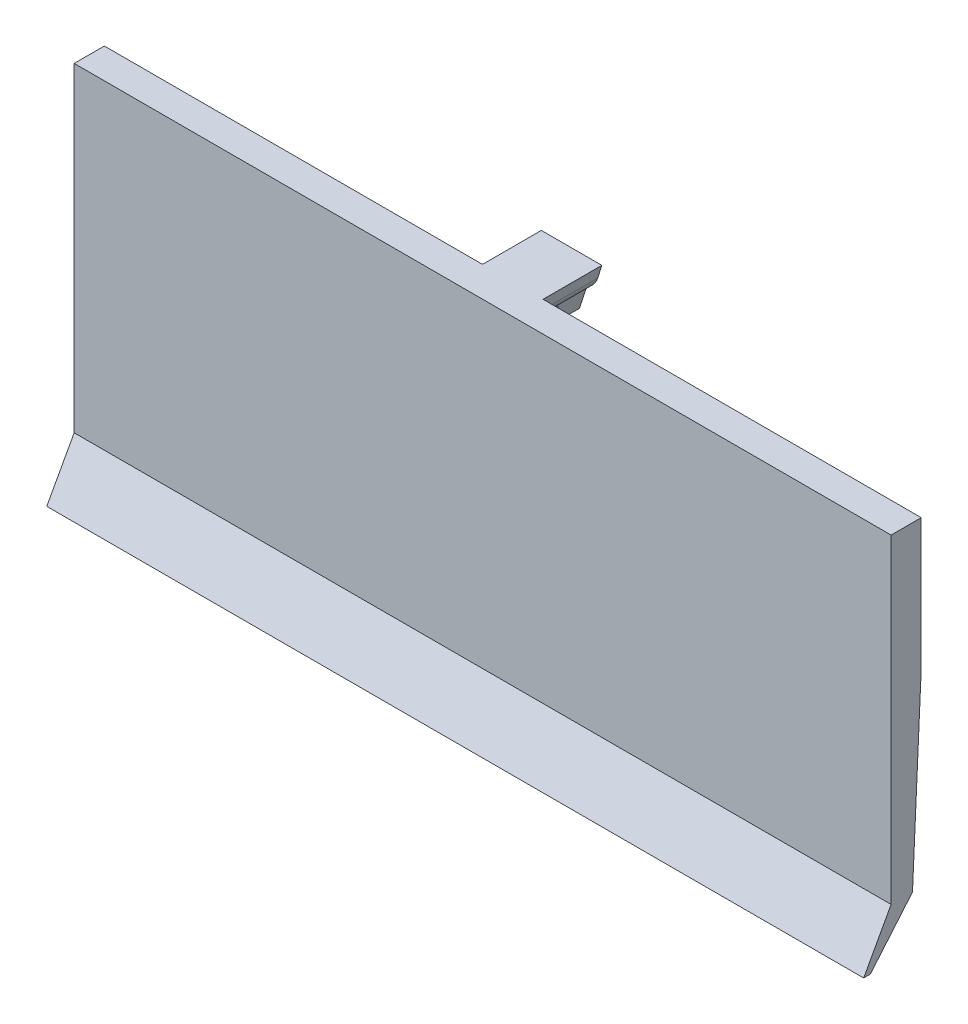
ISO-10303-21;
HEADER;
FILE_DESCRIPTION(('STEP AP214'),'2;1');
FILE_NAME('part.step','',(''),(''),'','','');
FILE_SCHEMA(('AUTOMOTIVE_DESIGN { 1 0 10303 214 1 1 1 1 }'));
ENDSEC;
DATA;
#1=APPLICATION_CONTEXT('core data for automotive mechanical design processes');
#2=APPLICATION_PROTOCOL_DEFINITION('international standard','automotive_design',2000,#1);
#3=PRODUCT_CONTEXT('',#1,'mechanical');
#4=PRODUCT('Part','Part','',(#3));
#5=PRODUCT_RELATED_PRODUCT_CATEGORY('part','',(#4));
#6=PRODUCT_DEFINITION_FORMATION('','',#4);
#7=PRODUCT_DEFINITION_CONTEXT('part definition',#1,'design');
#8=PRODUCT_DEFINITION('design','',#6,#7);
#9=PRODUCT_DEFINITION_SHAPE('','',#8);
#10=(LENGTH_UNIT() NAMED_UNIT(*) SI_UNIT(.MILLI.,.METRE.));
#11=(NAMED_UNIT(*) PLANE_ANGLE_UNIT() SI_UNIT($,.RADIAN.));
#12=(NAMED_UNIT(*) SI_UNIT($,.STERADIAN.) SOLID_ANGLE_UNIT());
#13=UNCERTAINTY_MEASURE_WITH_UNIT(LENGTH_MEASURE(1.E-05),#10,'distance_accuracy_value','');
#14=(GEOMETRIC_REPRESENTATION_CONTEXT(3) GLOBAL_UNCERTAINTY_ASSIGNED_CONTEXT((#13)) GLOBAL_UNIT_ASSIGNED_CONTEXT((#10,
#11,#12)) REPRESENTATION_CONTEXT('',''));
#15=CARTESIAN_POINT('',(0.,0.,0.));
#16=DIRECTION('',(0.,0.,1.));
#17=DIRECTION('',(1.,0.,0.));
#18=AXIS2_PLACEMENT_3D('',#15,#16,#17);
#19=CARTESIAN_POINT('',(2.,13.5310606962633,-2.05934769968656));
#20=DIRECTION('',(0.,-1.,0.));
#21=DIRECTION('',(0.,0.,-1.));
#22=AXIS2_PLACEMENT_3D('',#19,#20,#21);
#23=PLANE('',#22);
#24=DIRECTION('',(0.,0.,1.));
#25=VECTOR('',#24,1.);
#26=CARTESIAN_POINT('',(-0.904683115915946,13.5310606962633,-2.05934769968656));
#27=LINE('',#26,#25);
#28=CARTESIAN_POINT('',(-0.904683115915947,13.5310606962633,-4.08024961440723));
#29=VERTEX_POINT('',#28);
#30=CARTESIAN_POINT('',(-0.904683115915946,13.5310606962633,-1.99278038803899));
#31=VERTEX_POINT('',#30);
#32=EDGE_CURVE('E285',#29,#31,#27,.T.);
#33=ORIENTED_EDGE('',*,*,#32,.F.);
#34=DIRECTION('',(-1.,0.,0.));
#35=VECTOR('',#34,1.);
#36=CARTESIAN_POINT('',(2.,13.5310606962633,-4.08024961440723));
#37=LINE('',#36,#35);
#38=CARTESIAN_POINT('',(0.904683115915946,13.5310606962633,-4.08024961440723));
#39=VERTEX_POINT('',#38);
#40=EDGE_CURVE('E189',#39,#29,#37,.T.);
#41=ORIENTED_EDGE('',*,*,#40,.F.);
#42=DIRECTION('',(0.,0.,1.));
#43=VECTOR('',#42,1.);
#44=CARTESIAN_POINT('',(0.904683115915946,13.5310606962633,-2.05934769968656));
#45=LINE('',#44,#43);
#46=CARTESIAN_POINT('',(0.904683115915946,13.5310606962633,-1.99278038803899));
#47=VERTEX_POINT('',#46);
#48=EDGE_CURVE('E280',#39,#47,#45,.T.);
#49=ORIENTED_EDGE('',*,*,#48,.T.);
#50=DIRECTION('',(-1.,0.,0.));
#51=VECTOR('',#50,1.);
#52=CARTESIAN_POINT('',(27.,13.5310606962633,-1.99278038803899));
#53=LINE('',#52,#51);
#54=EDGE_CURVE('E11',#47,#31,#53,.T.);
#55=ORIENTED_EDGE('',*,*,#54,.T.);
#56=EDGE_LOOP('',(#33,#41,#49,#55));
#57=FACE_BOUND('',#56,.T.);
#58=ADVANCED_FACE('F35',(#57),#23,.T.);
#59=CARTESIAN_POINT('',(2.,12.3310606962633,-4.08024961440723));
#60=DIRECTION('',(0.,0.,1.));
#61=DIRECTION('',(1.,0.,0.));
#62=AXIS2_PLACEMENT_3D('',#59,#60,#61);
#63=PLANE('',#62);
#64=DIRECTION('',(-0.302806507428233,0.953052054747859,0.));
#65=VECTOR('',#64,1.);
#66=CARTESIAN_POINT('',(-0.292039111034096,11.6028272753881,-4.08024961440723));
#67=LINE('',#66,#65);
#68=CARTESIAN_POINT('',(-0.523415579579736,12.3310606962633,-4.08024961440723));
#69=VERTEX_POINT('',#68);
#70=EDGE_CURVE('E283',#69,#29,#67,.T.);
#71=ORIENTED_EDGE('',*,*,#70,.F.);
#72=DIRECTION('',(-1.,0.,0.));
#73=VECTOR('',#72,1.);
#74=CARTESIAN_POINT('',(2.,12.3310606962633,-4.08024961440723));
#75=LINE('',#74,#73);
#76=CARTESIAN_POINT('',(0.523415579579736,12.3310606962633,-4.08024961440723));
#77=VERTEX_POINT('',#76);
#78=EDGE_CURVE('E291',#77,#69,#75,.T.);
#79=ORIENTED_EDGE('',*,*,#78,.F.);
#80=DIRECTION('',(0.302806507428233,0.953052054747859,0.));
#81=VECTOR('',#80,1.);
#82=CARTESIAN_POINT('',(0.658806234797634,12.7571887317701,-4.08024961440723));
#83=LINE('',#82,#81);
#84=EDGE_CURVE('E257',#77,#39,#83,.T.);
#85=ORIENTED_EDGE('',*,*,#84,.T.);
#86=ORIENTED_EDGE('',*,*,#40,.T.);
#87=EDGE_LOOP('',(#71,#79,#85,#86));
#88=FACE_BOUND('',#87,.T.);
#89=ADVANCED_FACE('F317',(#88),#63,.T.);
#90=CARTESIAN_POINT('',(2.,12.3310606962633,-5.88024961440723));
#91=DIRECTION('',(0.,-1.,0.));
#92=DIRECTION('',(0.,0.,-1.));
#93=AXIS2_PLACEMENT_3D('',#90,#91,#92);
#94=PLANE('',#93);
#95=DIRECTION('',(0.,0.,-1.));
#96=VECTOR('',#95,1.);
#97=CARTESIAN_POINT('',(-0.523415579579736,12.3310606962633,1.53146443186609));
#98=LINE('',#97,#96);
#99=CARTESIAN_POINT('',(-0.523415579579736,12.3310606962633,-5.88024961440723));
#100=VERTEX_POINT('',#99);
#101=EDGE_CURVE('E238',#69,#100,#98,.T.);
#102=ORIENTED_EDGE('',*,*,#101,.T.);
#103=DIRECTION('',(-1.,0.,0.));
#104=VECTOR('',#103,1.);
#105=CARTESIAN_POINT('',(2.,12.3310606962633,-5.88024961440723));
#106=LINE('',#105,#104);
#107=CARTESIAN_POINT('',(0.523415579579736,12.3310606962633,-5.88024961440723));
#108=VERTEX_POINT('',#107);
#109=EDGE_CURVE('E293',#108,#100,#106,.T.);
#110=ORIENTED_EDGE('',*,*,#109,.F.);
#111=DIRECTION('',(0.,0.,-1.));
#112=VECTOR('',#111,1.);
#113=CARTESIAN_POINT('',(0.523415579579736,12.3310606962633,1.53146443186609));
#114=LINE('',#113,#112);
#115=EDGE_CURVE('E263',#77,#108,#114,.T.);
#116=ORIENTED_EDGE('',*,*,#115,.F.);
#117=ORIENTED_EDGE('',*,*,#78,.T.);
#118=EDGE_LOOP('',(#102,#110,#116,#117));
#119=FACE_BOUND('',#118,.T.);
#120=ADVANCED_FACE('F324',(#119),#94,.T.);
#121=CARTESIAN_POINT('',(2.,15.5310606962633,-5.88024961440723));
#122=DIRECTION('',(0.,0.,-1.));
#123=DIRECTION('',(-1.,0.,0.));
#124=AXIS2_PLACEMENT_3D('',#121,#122,#123);
#125=PLANE('',#124);
#126=DIRECTION('',(0.302806507428234,-0.953052054747858,0.));
#127=VECTOR('',#126,1.);
#128=CARTESIAN_POINT('',(2.66549802300572,0.846889886950362,-5.88024961440723));
#129=LINE('',#128,#127);
#130=CARTESIAN_POINT('',(-2.,15.5310606962633,-5.88024961440723));
#131=VERTEX_POINT('',#130);
#132=CARTESIAN_POINT('',(-1.72306087484239,14.6594235425139,-5.88024961440723));
#133=VERTEX_POINT('',#132);
#134=EDGE_CURVE('E241',#131,#133,#129,.T.);
#135=ORIENTED_EDGE('',*,*,#134,.F.);
#136=DIRECTION('',(-1.,0.,0.));
#137=VECTOR('',#136,1.);
#138=CARTESIAN_POINT('',(2.,15.5310606962633,-5.88024961440723));
#139=LINE('',#138,#137);
#140=CARTESIAN_POINT('',(2.,15.5310606962633,-5.88024961440723));
#141=VERTEX_POINT('',#140);
#142=EDGE_CURVE('E182',#141,#131,#139,.T.);
#143=ORIENTED_EDGE('',*,*,#142,.F.);
#144=DIRECTION('',(-0.302806507428234,-0.953052054747858,0.));
#145=VECTOR('',#144,1.);
#146=CARTESIAN_POINT('',(2.,15.5310606962633,-5.88024961440723));
#147=LINE('',#146,#145);
#148=CARTESIAN_POINT('',(1.72306087484239,14.6594235425139,-5.88024961440723));
#149=VERTEX_POINT('',#148);
#150=EDGE_CURVE('E245',#141,#149,#147,.T.);
#151=ORIENTED_EDGE('',*,*,#150,.T.);
#152=CARTESIAN_POINT('',(0.408559569513449,15.0770707710085,-5.88024961440723));
#153=DIRECTION('',(0.,0.,-1.));
#154=DIRECTION('',(-1.,0.,0.));
#155=AXIS2_PLACEMENT_3D('',#152,#153,#154);
#156=CIRCLE('',#155,1.37925446861002);
#157=CARTESIAN_POINT('',(1.,13.8310606962633,-5.88024961440723));
#158=VERTEX_POINT('',#157);
#159=EDGE_CURVE('E268',#149,#158,#156,.T.);
#160=ORIENTED_EDGE('',*,*,#159,.T.);
#161=DIRECTION('',(-0.302806507428233,-0.953052054747859,0.));
#162=VECTOR('',#161,1.);
#163=CARTESIAN_POINT('',(1.,13.8310606962633,-5.88024961440723));
#164=LINE('',#163,#162);
#165=EDGE_CURVE('E265',#158,#108,#164,.T.);
#166=ORIENTED_EDGE('',*,*,#165,.T.);
#167=ORIENTED_EDGE('',*,*,#109,.T.);
#168=DIRECTION('',(0.302806507428233,-0.953052054747859,0.));
#169=VECTOR('',#168,1.);
#170=CARTESIAN_POINT('',(3.08320262310248,0.979604223446354,-5.88024961440723));
#171=LINE('',#170,#169);
#172=CARTESIAN_POINT('',(-1.,13.8310606962633,-5.88024961440723));
#173=VERTEX_POINT('',#172);
#174=EDGE_CURVE('E248',#173,#100,#171,.T.);
#175=ORIENTED_EDGE('',*,*,#174,.F.);
#176=CARTESIAN_POINT('',(-0.408559569513449,15.0770707710085,-5.88024961440723));
#177=DIRECTION('',(0.,0.,-1.));
#178=DIRECTION('',(-1.,0.,0.));
#179=AXIS2_PLACEMENT_3D('',#176,#177,#178);
#180=CIRCLE('',#179,1.37925446861002);
#181=EDGE_CURVE('E244',#133,#173,#180,.F.);
#182=ORIENTED_EDGE('',*,*,#181,.F.);
#183=EDGE_LOOP('',(#135,#143,#151,#160,#166,#167,#175,#182));
#184=FACE_BOUND('',#183,.T.);
#185=ADVANCED_FACE('F300',(#184),#125,.T.);
#186=CARTESIAN_POINT('',(27.,15.5310606962633,-1.99278038803899));
#187=DIRECTION('',(0.,0.,-1.));
#188=DIRECTION('',(-1.,0.,0.));
#189=AXIS2_PLACEMENT_3D('',#186,#187,#188);
#190=PLANE('',#189);
#191=ORIENTED_EDGE('',*,*,#54,.F.);
#192=DIRECTION('',(0.302806507428233,0.953052054747859,0.));
#193=VECTOR('',#192,1.);
#194=CARTESIAN_POINT('',(1.,13.8310606962633,-1.99278038803899));
#195=LINE('',#194,#193);
#196=CARTESIAN_POINT('',(1.,13.8310606962633,-1.99278038803899));
#197=VERTEX_POINT('',#196);
#198=EDGE_CURVE('E261',#47,#197,#195,.T.);
#199=ORIENTED_EDGE('',*,*,#198,.T.);
#200=CARTESIAN_POINT('',(0.408559569513449,15.0770707710085,-1.99278038803899));
#201=DIRECTION('',(0.,0.,-1.));
#202=DIRECTION('',(-1.,0.,0.));
#203=AXIS2_PLACEMENT_3D('',#200,#201,#202);
#204=CIRCLE('',#203,1.37925446861002);
#205=CARTESIAN_POINT('',(1.72306087484239,14.6594235425139,-1.99278038803899));
#206=VERTEX_POINT('',#205);
#207=EDGE_CURVE('E274',#197,#206,#204,.F.);
#208=ORIENTED_EDGE('',*,*,#207,.T.);
#209=DIRECTION('',(0.302806507428234,0.953052054747858,0.));
#210=VECTOR('',#209,1.);
#211=CARTESIAN_POINT('',(2.,15.5310606962633,-1.99278038803899));
#212=LINE('',#211,#210);
#213=CARTESIAN_POINT('',(2.,15.5310606962633,-1.99278038803899));
#214=VERTEX_POINT('',#213);
#215=EDGE_CURVE('E218',#206,#214,#212,.T.);
#216=ORIENTED_EDGE('',*,*,#215,.T.);
#217=DIRECTION('',(-1.,0.,0.));
#218=VECTOR('',#217,1.);
#219=CARTESIAN_POINT('',(27.,15.5310606962633,-1.99278038803899));
#220=LINE('',#219,#218);
#221=CARTESIAN_POINT('',(27.,15.5310606962633,-1.99278038803899));
#222=VERTEX_POINT('',#221);
#223=EDGE_CURVE('E170',#222,#214,#220,.T.);
#224=ORIENTED_EDGE('',*,*,#223,.F.);
#225=DIRECTION('',(0.,-1.,0.));
#226=VECTOR('',#225,1.);
#227=CARTESIAN_POINT('',(27.,8.96643723347743,-1.992780388039));
#228=LINE('',#227,#226);
#229=CARTESIAN_POINT('',(27.,6.90761674369138,-1.992780388039));
#230=VERTEX_POINT('',#229);
#231=EDGE_CURVE('E157',#222,#230,#228,.T.);
#232=ORIENTED_EDGE('',*,*,#231,.T.);
#233=DIRECTION('',(-1.,0.,0.));
#234=VECTOR('',#233,1.);
#235=CARTESIAN_POINT('',(27.,6.90761674369138,-1.992780388039));
#236=LINE('',#235,#234);
#237=CARTESIAN_POINT('',(-27.,6.90761674369138,-1.992780388039));
#238=VERTEX_POINT('',#237);
#239=EDGE_CURVE('E43',#230,#238,#236,.T.);
#240=ORIENTED_EDGE('',*,*,#239,.T.);
#241=DIRECTION('',(0.,-1.,0.));
#242=VECTOR('',#241,1.);
#243=CARTESIAN_POINT('',(-27.,15.5310606962633,-1.99278038803899));
#244=LINE('',#243,#242);
#245=CARTESIAN_POINT('',(-27.,15.5310606962633,-1.99278038803899));
#246=VERTEX_POINT('',#245);
#247=EDGE_CURVE('E187',#246,#238,#244,.T.);
#248=ORIENTED_EDGE('',*,*,#247,.F.);
#249=CARTESIAN_POINT('',(-2.,15.5310606962633,-1.99278038803899));
#250=VERTEX_POINT('',#249);
#251=EDGE_CURVE('E194',#250,#246,#220,.T.);
#252=ORIENTED_EDGE('',*,*,#251,.F.);
#253=DIRECTION('',(-0.302806507428234,0.953052054747859,0.));
#254=VECTOR('',#253,1.);
#255=CARTESIAN_POINT('',(2.66549802300572,0.846889886950362,-1.99278038803899));
#256=LINE('',#255,#254);
#257=CARTESIAN_POINT('',(-1.72306087484239,14.6594235425139,-1.99278038803899));
#258=VERTEX_POINT('',#257);
#259=EDGE_CURVE('E237',#258,#250,#256,.T.);
#260=ORIENTED_EDGE('',*,*,#259,.F.);
#261=CARTESIAN_POINT('',(-0.408559569513449,15.0770707710085,-1.99278038803899));
#262=DIRECTION('',(0.,0.,-1.));
#263=DIRECTION('',(-1.,0.,0.));
#264=AXIS2_PLACEMENT_3D('',#261,#262,#263);
#265=CIRCLE('',#264,1.37925446861002);
#266=CARTESIAN_POINT('',(-1.,13.8310606962633,-1.99278038803899));
#267=VERTEX_POINT('',#266);
#268=EDGE_CURVE('E240',#267,#258,#265,.T.);
#269=ORIENTED_EDGE('',*,*,#268,.F.);
#270=DIRECTION('',(-0.302806507428233,0.953052054747859,0.));
#271=VECTOR('',#270,1.);
#272=CARTESIAN_POINT('',(3.08320262310248,0.979604223446354,-1.99278038803899));
#273=LINE('',#272,#271);
#274=EDGE_CURVE('E235',#31,#267,#273,.T.);
#275=ORIENTED_EDGE('',*,*,#274,.F.);
#276=EDGE_LOOP('',(#191,#199,#208,#216,#224,#232,#240,#248,#252,#260,#269,#275));
#277=FACE_BOUND('',#276,.T.);
#278=ADVANCED_FACE('F37',(#277),#190,.T.);
#279=CARTESIAN_POINT('',(27.,15.5310606962633,0.));
#280=DIRECTION('',(0.,1.,0.));
#281=DIRECTION('',(0.,0.,1.));
#282=AXIS2_PLACEMENT_3D('',#279,#280,#281);
#283=PLANE('',#282);
#284=ORIENTED_EDGE('',*,*,#223,.T.);
#285=DIRECTION('',(0.,0.,-1.));
#286=VECTOR('',#285,1.);
#287=CARTESIAN_POINT('',(2.,15.5310606962633,-1.88024961440723));
#288=LINE('',#287,#286);
#289=EDGE_CURVE('E58',#214,#141,#288,.T.);
#290=ORIENTED_EDGE('',*,*,#289,.T.);
#291=ORIENTED_EDGE('',*,*,#142,.T.);
#292=DIRECTION('',(0.,0.,-1.));
#293=VECTOR('',#292,1.);
#294=CARTESIAN_POINT('',(-2.,15.5310606962633,-1.88024961440723));
#295=LINE('',#294,#293);
#296=EDGE_CURVE('E202',#250,#131,#295,.T.);
#297=ORIENTED_EDGE('',*,*,#296,.F.);
#298=ORIENTED_EDGE('',*,*,#251,.T.);
#299=DIRECTION('',(0.,0.,-1.));
#300=VECTOR('',#299,1.);
#301=CARTESIAN_POINT('',(-27.,15.5310606962633,0.));
#302=LINE('',#301,#300);
#303=CARTESIAN_POINT('',(-27.,15.5310606962633,0.));
#304=VERTEX_POINT('',#303);
#305=EDGE_CURVE('E179',#304,#246,#302,.T.);
#306=ORIENTED_EDGE('',*,*,#305,.F.);
#307=DIRECTION('',(-1.,0.,0.));
#308=VECTOR('',#307,1.);
#309=CARTESIAN_POINT('',(27.,15.5310606962633,0.));
#310=LINE('',#309,#308);
#311=CARTESIAN_POINT('',(27.,15.5310606962633,0.));
#312=VERTEX_POINT('',#311);
#313=EDGE_CURVE('E186',#312,#304,#310,.T.);
#314=ORIENTED_EDGE('',*,*,#313,.F.);
#315=DIRECTION('',(0.,0.,-1.));
#316=VECTOR('',#315,1.);
#317=CARTESIAN_POINT('',(27.,15.5310606962633,0.));
#318=LINE('',#317,#316);
#319=EDGE_CURVE('E174',#312,#222,#318,.T.);
#320=ORIENTED_EDGE('',*,*,#319,.T.);
#321=EDGE_LOOP('',(#284,#290,#291,#297,#298,#306,#314,#320));
#322=FACE_BOUND('',#321,.T.);
#323=ADVANCED_FACE('F199',(#322),#283,.T.);
#324=CARTESIAN_POINT('',(27.,9.02431694988647,0.));
#325=DIRECTION('',(0.,0.,-1.));
#326=DIRECTION('',(-1.,0.,0.));
#327=AXIS2_PLACEMENT_3D('',#324,#325,#326);
#328=PLANE('',#327);
#329=DIRECTION('',(0.,-1.,0.));
#330=VECTOR('',#329,1.);
#331=CARTESIAN_POINT('',(-27.,9.02431694988647,0.));
#332=LINE('',#331,#330);
#333=CARTESIAN_POINT('',(-27.,-5.61403660865612,0.));
#334=VERTEX_POINT('',#333);
#335=EDGE_CURVE('E175',#304,#334,#332,.T.);
#336=ORIENTED_EDGE('',*,*,#335,.T.);
#337=DIRECTION('',(-1.,0.,0.));
#338=VECTOR('',#337,1.);
#339=CARTESIAN_POINT('',(-27.,-5.61403660865612,0.));
#340=LINE('',#339,#338);
#341=CARTESIAN_POINT('',(27.,-5.61403660865612,0.));
#342=VERTEX_POINT('',#341);
#343=EDGE_CURVE('E216',#342,#334,#340,.T.);
#344=ORIENTED_EDGE('',*,*,#343,.F.);
#345=DIRECTION('',(0.,1.,0.));
#346=VECTOR('',#345,1.);
#347=CARTESIAN_POINT('',(27.,13.2651250637372,0.));
#348=LINE('',#347,#346);
#349=EDGE_CURVE('E177',#342,#312,#348,.T.);
#350=ORIENTED_EDGE('',*,*,#349,.T.);
#351=ORIENTED_EDGE('',*,*,#313,.T.);
#352=EDGE_LOOP('',(#336,#344,#350,#351));
#353=FACE_BOUND('',#352,.T.);
#354=ADVANCED_FACE('F212',(#353),#328,.F.);
#355=CARTESIAN_POINT('',(27.,0.,0.));
#356=DIRECTION('',(1.,0.,0.));
#357=DIRECTION('',(0.,0.,-1.));
#358=AXIS2_PLACEMENT_3D('',#355,#356,#357);
#359=PLANE('',#358);
#360=DIRECTION('',(0.,0.998933752325638,-0.0461666380043041));
#361=VECTOR('',#360,1.);
#362=CARTESIAN_POINT('',(27.,-5.61403660865612,-1.41408071332347));
#363=LINE('',#362,#361);
#364=CARTESIAN_POINT('',(27.,-5.61403660865612,-1.41408071332347));
#365=VERTEX_POINT('',#364);
#366=EDGE_CURVE('E50',#365,#230,#363,.T.);
#367=ORIENTED_EDGE('',*,*,#366,.T.);
#368=ORIENTED_EDGE('',*,*,#231,.F.);
#369=ORIENTED_EDGE('',*,*,#319,.F.);
#370=ORIENTED_EDGE('',*,*,#349,.F.);
#371=DIRECTION('',(0.,-0.876920146358568,0.480636096137679));
#372=VECTOR('',#371,1.);
#373=CARTESIAN_POINT('',(27.,-5.61403660865612,0.));
#374=LINE('',#373,#372);
#375=CARTESIAN_POINT('',(27.,-8.91935105484643,1.81162838888045));
#376=VERTEX_POINT('',#375);
#377=EDGE_CURVE('E215',#342,#376,#374,.T.);
#378=ORIENTED_EDGE('',*,*,#377,.T.);
#379=DIRECTION('',(0.,0.,-1.));
#380=VECTOR('',#379,1.);
#381=CARTESIAN_POINT('',(27.,-8.91935105484643,1.81162838888045));
#382=LINE('',#381,#380);
#383=CARTESIAN_POINT('',(27.,-8.91935105484643,1.37009012760362));
#384=VERTEX_POINT('',#383);
#385=EDGE_CURVE('E223',#376,#384,#382,.T.);
#386=ORIENTED_EDGE('',*,*,#385,.T.);
#387=DIRECTION('',(0.,0.764825895825653,-0.644237028642787));
#388=VECTOR('',#387,1.);
#389=CARTESIAN_POINT('',(27.,-8.91935105484643,1.37009012760362));
#390=LINE('',#389,#388);
#391=EDGE_CURVE('E161',#384,#365,#390,.T.);
#392=ORIENTED_EDGE('',*,*,#391,.T.);
#393=EDGE_LOOP('',(#367,#368,#369,#370,#378,#386,#392));
#394=FACE_BOUND('',#393,.T.);
#395=ADVANCED_FACE('F154',(#394),#359,.T.);
#396=CARTESIAN_POINT('',(-27.,0.,0.));
#397=DIRECTION('',(1.,0.,0.));
#398=DIRECTION('',(0.,0.,-1.));
#399=AXIS2_PLACEMENT_3D('',#396,#397,#398);
#400=PLANE('',#399);
#401=ORIENTED_EDGE('',*,*,#247,.T.);
#402=DIRECTION('',(0.,-0.998933752325638,0.0461666380043041));
#403=VECTOR('',#402,1.);
#404=CARTESIAN_POINT('',(-27.,-5.61403660865612,-1.41408071332347));
#405=LINE('',#404,#403);
#406=CARTESIAN_POINT('',(-27.,-5.61403660865612,-1.41408071332347));
#407=VERTEX_POINT('',#406);
#408=EDGE_CURVE('E166',#238,#407,#405,.T.);
#409=ORIENTED_EDGE('',*,*,#408,.T.);
#410=DIRECTION('',(0.,-0.764825895825653,0.644237028642787));
#411=VECTOR('',#410,1.);
#412=CARTESIAN_POINT('',(-27.,-8.91935105484643,1.37009012760362));
#413=LINE('',#412,#411);
#414=CARTESIAN_POINT('',(-27.,-8.91935105484643,1.37009012760362));
#415=VERTEX_POINT('',#414);
#416=EDGE_CURVE('E541',#407,#415,#413,.T.);
#417=ORIENTED_EDGE('',*,*,#416,.T.);
#418=DIRECTION('',(0.,0.,1.));
#419=VECTOR('',#418,1.);
#420=CARTESIAN_POINT('',(-27.,-8.91935105484643,1.81162838888045));
#421=LINE('',#420,#419);
#422=CARTESIAN_POINT('',(-27.,-8.91935105484643,1.81162838888045));
#423=VERTEX_POINT('',#422);
#424=EDGE_CURVE('E543',#415,#423,#421,.T.);
#425=ORIENTED_EDGE('',*,*,#424,.T.);
#426=DIRECTION('',(0.,0.876920146358568,-0.480636096137679));
#427=VECTOR('',#426,1.);
#428=CARTESIAN_POINT('',(-27.,-5.61403660865612,0.));
#429=LINE('',#428,#427);
#430=EDGE_CURVE('E208',#423,#334,#429,.T.);
#431=ORIENTED_EDGE('',*,*,#430,.T.);
#432=ORIENTED_EDGE('',*,*,#335,.F.);
#433=ORIENTED_EDGE('',*,*,#305,.T.);
#434=EDGE_LOOP('',(#401,#409,#417,#425,#431,#432,#433));
#435=FACE_BOUND('',#434,.T.);
#436=ADVANCED_FACE('F205',(#435),#400,.F.);
#437=CARTESIAN_POINT('',(2.66549802300572,0.846889886950362,1.53146443186609));
#438=DIRECTION('',(0.953052054747859,0.302806507428234,0.));
#439=DIRECTION('',(-0.302806507428234,0.953052054747859,0.));
#440=AXIS2_PLACEMENT_3D('',#437,#438,#439);
#441=PLANE('',#440);
#442=ORIENTED_EDGE('',*,*,#259,.T.);
#443=ORIENTED_EDGE('',*,*,#296,.T.);
#444=ORIENTED_EDGE('',*,*,#134,.T.);
#445=DIRECTION('',(0.,0.,-1.));
#446=VECTOR('',#445,1.);
#447=CARTESIAN_POINT('',(-1.72306087484239,14.6594235425139,1.53146443186609));
#448=LINE('',#447,#446);
#449=EDGE_CURVE('E250',#258,#133,#448,.T.);
#450=ORIENTED_EDGE('',*,*,#449,.F.);
#451=EDGE_LOOP('',(#442,#443,#444,#450));
#452=FACE_BOUND('',#451,.T.);
#453=ADVANCED_FACE('F304',(#452),#441,.F.);
#454=CARTESIAN_POINT('',(3.08320262310248,0.979604223446354,1.53146443186609));
#455=DIRECTION('',(0.953052054747859,0.302806507428233,0.));
#456=DIRECTION('',(-0.302806507428233,0.953052054747859,0.));
#457=AXIS2_PLACEMENT_3D('',#454,#455,#456);
#458=PLANE('',#457);
#459=ORIENTED_EDGE('',*,*,#32,.T.);
#460=ORIENTED_EDGE('',*,*,#274,.T.);
#461=DIRECTION('',(0.,0.,-1.));
#462=VECTOR('',#461,1.);
#463=CARTESIAN_POINT('',(-1.,13.8310606962633,1.53146443186609));
#464=LINE('',#463,#462);
#465=EDGE_CURVE('E253',#267,#173,#464,.T.);
#466=ORIENTED_EDGE('',*,*,#465,.T.);
#467=ORIENTED_EDGE('',*,*,#174,.T.);
#468=ORIENTED_EDGE('',*,*,#101,.F.);
#469=ORIENTED_EDGE('',*,*,#70,.T.);
#470=EDGE_LOOP('',(#459,#460,#466,#467,#468,#469));
#471=FACE_BOUND('',#470,.T.);
#472=ADVANCED_FACE('F311',(#471),#458,.F.);
#473=CARTESIAN_POINT('',(-0.408559569513449,15.0770707710085,1.53146443186609));
#474=DIRECTION('',(0.,0.,-1.));
#475=DIRECTION('',(-1.,0.,0.));
#476=AXIS2_PLACEMENT_3D('',#473,#474,#475);
#477=CYLINDRICAL_SURFACE('',#476,1.37925446861002);
#478=ORIENTED_EDGE('',*,*,#268,.T.);
#479=ORIENTED_EDGE('',*,*,#449,.T.);
#480=ORIENTED_EDGE('',*,*,#181,.T.);
#481=ORIENTED_EDGE('',*,*,#465,.F.);
#482=EDGE_LOOP('',(#478,#479,#480,#481));
#483=FACE_BOUND('',#482,.T.);
#484=ADVANCED_FACE('F309',(#483),#477,.T.);
#485=CARTESIAN_POINT('',(2.,15.5310606962633,1.53146443186609));
#486=DIRECTION('',(0.953052054747858,-0.302806507428234,0.));
#487=DIRECTION('',(0.302806507428234,0.953052054747858,0.));
#488=AXIS2_PLACEMENT_3D('',#485,#486,#487);
#489=PLANE('',#488);
#490=DIRECTION('',(0.,0.,-1.));
#491=VECTOR('',#490,1.);
#492=CARTESIAN_POINT('',(1.72306087484239,14.6594235425139,1.53146443186609));
#493=LINE('',#492,#491);
#494=EDGE_CURVE('E258',#206,#149,#493,.T.);
#495=ORIENTED_EDGE('',*,*,#494,.T.);
#496=ORIENTED_EDGE('',*,*,#150,.F.);
#497=ORIENTED_EDGE('',*,*,#289,.F.);
#498=ORIENTED_EDGE('',*,*,#215,.F.);
#499=EDGE_LOOP('',(#495,#496,#497,#498));
#500=FACE_BOUND('',#499,.T.);
#501=ADVANCED_FACE('F343',(#500),#489,.T.);
#502=CARTESIAN_POINT('',(0.408559569513449,15.0770707710085,1.53146443186609));
#503=DIRECTION('',(0.,0.,-1.));
#504=DIRECTION('',(-1.,0.,0.));
#505=AXIS2_PLACEMENT_3D('',#502,#503,#504);
#506=CYLINDRICAL_SURFACE('',#505,1.37925446861002);
#507=DIRECTION('',(0.,0.,-1.));
#508=VECTOR('',#507,1.);
#509=CARTESIAN_POINT('',(1.,13.8310606962633,1.53146443186609));
#510=LINE('',#509,#508);
#511=EDGE_CURVE('E260',#197,#158,#510,.T.);
#512=ORIENTED_EDGE('',*,*,#511,.T.);
#513=ORIENTED_EDGE('',*,*,#159,.F.);
#514=ORIENTED_EDGE('',*,*,#494,.F.);
#515=ORIENTED_EDGE('',*,*,#207,.F.);
#516=EDGE_LOOP('',(#512,#513,#514,#515));
#517=FACE_BOUND('',#516,.T.);
#518=ADVANCED_FACE('F340',(#517),#506,.T.);
#519=CARTESIAN_POINT('',(1.,13.8310606962633,1.53146443186609));
#520=DIRECTION('',(0.953052054747859,-0.302806507428233,0.));
#521=DIRECTION('',(0.302806507428233,0.953052054747859,0.));
#522=AXIS2_PLACEMENT_3D('',#519,#520,#521);
#523=PLANE('',#522);
#524=ORIENTED_EDGE('',*,*,#84,.F.);
#525=ORIENTED_EDGE('',*,*,#115,.T.);
#526=ORIENTED_EDGE('',*,*,#165,.F.);
#527=ORIENTED_EDGE('',*,*,#511,.F.);
#528=ORIENTED_EDGE('',*,*,#198,.F.);
#529=ORIENTED_EDGE('',*,*,#48,.F.);
#530=EDGE_LOOP('',(#524,#525,#526,#527,#528,#529));
#531=FACE_BOUND('',#530,.T.);
#532=ADVANCED_FACE('F321',(#531),#523,.T.);
#533=CARTESIAN_POINT('',(-43.2777896484091,-5.61403660865612,-1.41408071332347));
#534=DIRECTION('',(0.,-0.0461666380043041,-0.998933752325638));
#535=DIRECTION('',(0.,0.998933752325638,-0.0461666380043041));
#536=AXIS2_PLACEMENT_3D('',#533,#534,#535);
#537=PLANE('',#536);
#538=ORIENTED_EDGE('',*,*,#366,.F.);
#539=DIRECTION('',(1.,0.,0.));
#540=VECTOR('',#539,1.);
#541=CARTESIAN_POINT('',(-43.2777896484091,-5.61403660865612,-1.41408071332347));
#542=LINE('',#541,#540);
#543=EDGE_CURVE('E230',#407,#365,#542,.T.);
#544=ORIENTED_EDGE('',*,*,#543,.F.);
#545=ORIENTED_EDGE('',*,*,#408,.F.);
#546=ORIENTED_EDGE('',*,*,#239,.F.);
#547=EDGE_LOOP('',(#538,#544,#545,#546));
#548=FACE_BOUND('',#547,.T.);
#549=ADVANCED_FACE('F165',(#548),#537,.T.);
#550=CARTESIAN_POINT('',(-43.2777896484091,-8.91935105484643,1.37009012760362));
#551=DIRECTION('',(0.,-0.644237028642787,-0.764825895825653));
#552=DIRECTION('',(0.,0.764825895825653,-0.644237028642787));
#553=AXIS2_PLACEMENT_3D('',#550,#551,#552);
#554=PLANE('',#553);
#555=ORIENTED_EDGE('',*,*,#416,.F.);
#556=ORIENTED_EDGE('',*,*,#543,.T.);
#557=ORIENTED_EDGE('',*,*,#391,.F.);
#558=DIRECTION('',(1.,0.,0.));
#559=VECTOR('',#558,1.);
#560=CARTESIAN_POINT('',(-43.2777896484091,-8.91935105484643,1.37009012760362));
#561=LINE('',#560,#559);
#562=EDGE_CURVE('E232',#415,#384,#561,.T.);
#563=ORIENTED_EDGE('',*,*,#562,.F.);
#564=EDGE_LOOP('',(#555,#556,#557,#563));
#565=FACE_BOUND('',#564,.T.);
#566=ADVANCED_FACE('F360',(#565),#554,.T.);
#567=CARTESIAN_POINT('',(-43.2777896484091,-8.91935105484643,1.81162838888045));
#568=DIRECTION('',(0.,-1.,0.));
#569=DIRECTION('',(0.,0.,-1.));
#570=AXIS2_PLACEMENT_3D('',#567,#568,#569);
#571=PLANE('',#570);
#572=ORIENTED_EDGE('',*,*,#424,.F.);
#573=ORIENTED_EDGE('',*,*,#562,.T.);
#574=ORIENTED_EDGE('',*,*,#385,.F.);
#575=DIRECTION('',(1.,0.,0.));
#576=VECTOR('',#575,1.);
#577=CARTESIAN_POINT('',(-43.2777896484091,-8.91935105484643,1.81162838888045));
#578=LINE('',#577,#576);
#579=EDGE_CURVE('E162',#423,#376,#578,.T.);
#580=ORIENTED_EDGE('',*,*,#579,.F.);
#581=EDGE_LOOP('',(#572,#573,#574,#580));
#582=FACE_BOUND('',#581,.T.);
#583=ADVANCED_FACE('F357',(#582),#571,.T.);
#584=CARTESIAN_POINT('',(-43.2777896484091,-5.61403660865612,0.));
#585=DIRECTION('',(0.,0.480636096137679,0.876920146358568));
#586=DIRECTION('',(0.,-0.876920146358568,0.480636096137679));
#587=AXIS2_PLACEMENT_3D('',#584,#585,#586);
#588=PLANE('',#587);
#589=ORIENTED_EDGE('',*,*,#430,.F.);
#590=ORIENTED_EDGE('',*,*,#579,.T.);
#591=ORIENTED_EDGE('',*,*,#377,.F.);
#592=ORIENTED_EDGE('',*,*,#343,.T.);
#593=EDGE_LOOP('',(#589,#590,#591,#592));
#594=FACE_BOUND('',#593,.T.);
#595=ADVANCED_FACE('F220',(#594),#588,.T.);
#596=CLOSED_SHELL('',(#58,#89,#120,#185,#278,#323,#354,#395,#436,#453,#472,#484,#501,#518,#532,
#549,#566,#583,#595));
#597=MANIFOLD_SOLID_BREP('B2',#596);
#598=ADVANCED_BREP_SHAPE_REPRESENTATION('',(#18,#597),#14);
#599=SHAPE_DEFINITION_REPRESENTATION(#9,#598);
ENDSEC;
END-ISO-10303-21;
